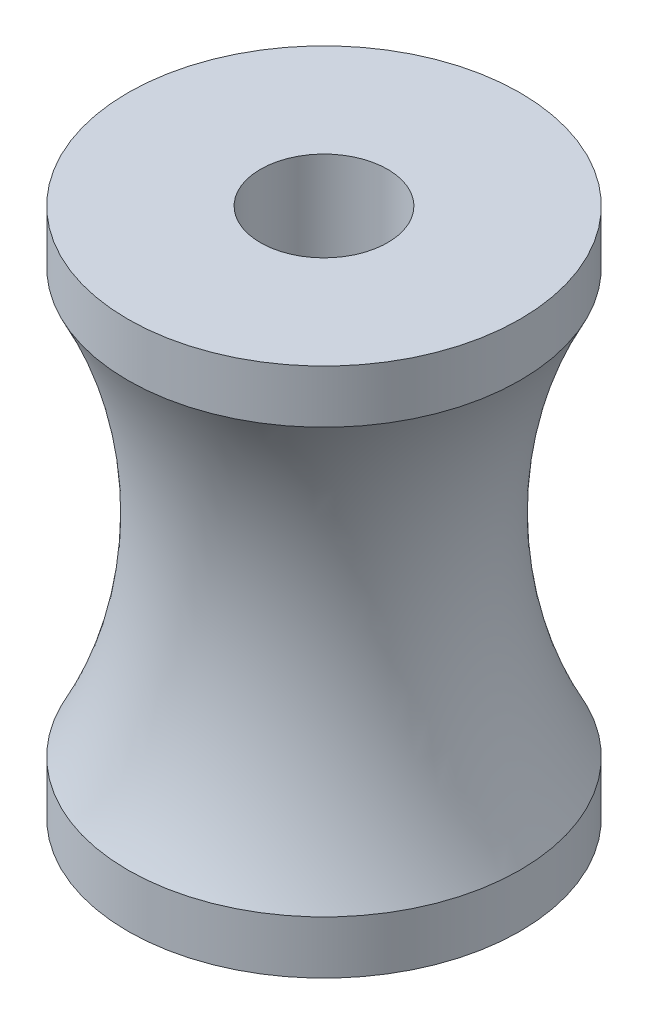
ISO-10303-21;
HEADER;
FILE_DESCRIPTION(('STEP AP214'),'2;1');
FILE_NAME('part.step','',(''),(''),'','','');
FILE_SCHEMA(('AUTOMOTIVE_DESIGN { 1 0 10303 214 1 1 1 1 }'));
ENDSEC;
DATA;
#1=APPLICATION_CONTEXT('core data for automotive mechanical design processes');
#2=APPLICATION_PROTOCOL_DEFINITION('international standard','automotive_design',2000,#1);
#3=PRODUCT_CONTEXT('',#1,'mechanical');
#4=PRODUCT('Part','Part','',(#3));
#5=PRODUCT_RELATED_PRODUCT_CATEGORY('part','',(#4));
#6=PRODUCT_DEFINITION_FORMATION('','',#4);
#7=PRODUCT_DEFINITION_CONTEXT('part definition',#1,'design');
#8=PRODUCT_DEFINITION('design','',#6,#7);
#9=PRODUCT_DEFINITION_SHAPE('','',#8);
#10=(LENGTH_UNIT() NAMED_UNIT(*) SI_UNIT(.MILLI.,.METRE.));
#11=(NAMED_UNIT(*) PLANE_ANGLE_UNIT() SI_UNIT($,.RADIAN.));
#12=(NAMED_UNIT(*) SI_UNIT($,.STERADIAN.) SOLID_ANGLE_UNIT());
#13=UNCERTAINTY_MEASURE_WITH_UNIT(LENGTH_MEASURE(1.E-05),#10,'distance_accuracy_value','');
#14=(GEOMETRIC_REPRESENTATION_CONTEXT(3) GLOBAL_UNCERTAINTY_ASSIGNED_CONTEXT((#13)) GLOBAL_UNIT_ASSIGNED_CONTEXT((#10,
#11,#12)) REPRESENTATION_CONTEXT('',''));
#15=CARTESIAN_POINT('',(0.,0.,0.));
#16=DIRECTION('',(0.,0.,1.));
#17=DIRECTION('',(1.,0.,0.));
#18=AXIS2_PLACEMENT_3D('',#15,#16,#17);
#19=CARTESIAN_POINT('',(-1.8302506003718E-13,500.,0.));
#20=DIRECTION('',(0.,1.,0.));
#21=DIRECTION('',(-1.,0.,0.));
#22=AXIS2_PLACEMENT_3D('',#19,#20,#21);
#23=CYLINDRICAL_SURFACE('',#22,120.);
#24=CARTESIAN_POINT('',(-1.8302506003718E-13,500.,0.));
#25=DIRECTION('',(0.,1.,0.));
#26=DIRECTION('',(-1.,0.,0.));
#27=AXIS2_PLACEMENT_3D('',#24,#25,#26);
#28=CIRCLE('',#27,120.);
#29=CARTESIAN_POINT('',(-120.,500.,0.));
#30=VERTEX_POINT('',#29);
#31=EDGE_CURVE('E70',#30,#30,#28,.T.);
#32=ORIENTED_EDGE('',*,*,#31,.T.);
#33=EDGE_LOOP('',(#32));
#34=FACE_BOUND('',#33,.T.);
#35=CARTESIAN_POINT('',(1.23136639749658E-13,-500.,0.));
#36=DIRECTION('',(0.,1.,0.));
#37=DIRECTION('',(-1.,0.,0.));
#38=AXIS2_PLACEMENT_3D('',#35,#36,#37);
#39=CIRCLE('',#38,120.);
#40=CARTESIAN_POINT('',(-120.,-500.,0.));
#41=VERTEX_POINT('',#40);
#42=EDGE_CURVE('E10',#41,#41,#39,.T.);
#43=ORIENTED_EDGE('',*,*,#42,.F.);
#44=EDGE_LOOP('',(#43));
#45=FACE_BOUND('',#44,.T.);
#46=ADVANCED_FACE('F43',(#34,#45),#23,.F.);
#47=CARTESIAN_POINT('',(-120.,-500.,0.));
#48=DIRECTION('',(0.,-1.,0.));
#49=DIRECTION('',(1.,0.,0.));
#50=AXIS2_PLACEMENT_3D('',#47,#48,#49);
#51=PLANE('',#50);
#52=ORIENTED_EDGE('',*,*,#42,.T.);
#53=EDGE_LOOP('',(#52));
#54=FACE_BOUND('',#53,.T.);
#55=CARTESIAN_POINT('',(1.23136639749658E-13,-500.,0.));
#56=DIRECTION('',(0.,1.,0.));
#57=DIRECTION('',(-1.,0.,0.));
#58=AXIS2_PLACEMENT_3D('',#55,#56,#57);
#59=CIRCLE('',#58,370.);
#60=CARTESIAN_POINT('',(-370.,-500.,0.));
#61=VERTEX_POINT('',#60);
#62=EDGE_CURVE('E50',#61,#61,#59,.T.);
#63=ORIENTED_EDGE('',*,*,#62,.F.);
#64=EDGE_LOOP('',(#63));
#65=FACE_BOUND('',#64,.T.);
#66=ADVANCED_FACE('F89',(#54,#65),#51,.T.);
#67=CARTESIAN_POINT('',(-1.8302506003718E-13,500.,0.));
#68=DIRECTION('',(0.,1.,0.));
#69=DIRECTION('',(-1.,0.,0.));
#70=AXIS2_PLACEMENT_3D('',#67,#68,#69);
#71=CYLINDRICAL_SURFACE('',#70,370.);
#72=ORIENTED_EDGE('',*,*,#62,.T.);
#73=EDGE_LOOP('',(#72));
#74=FACE_BOUND('',#73,.T.);
#75=CARTESIAN_POINT('',(0.,-400.,0.));
#76=DIRECTION('',(0.,1.,0.));
#77=DIRECTION('',(-1.,0.,0.));
#78=AXIS2_PLACEMENT_3D('',#75,#76,#77);
#79=CIRCLE('',#78,370.);
#80=CARTESIAN_POINT('',(-370.,-400.,0.));
#81=VERTEX_POINT('',#80);
#82=EDGE_CURVE('E55',#81,#81,#79,.T.);
#83=ORIENTED_EDGE('',*,*,#82,.F.);
#84=EDGE_LOOP('',(#83));
#85=FACE_BOUND('',#84,.T.);
#86=ADVANCED_FACE('F93',(#74,#85),#71,.T.);
#87=CARTESIAN_POINT('',(0.,2.22044604925031E-13,0.));
#88=DIRECTION('',(0.,1.,0.));
#89=DIRECTION('',(-1.,0.,0.));
#90=AXIS2_PLACEMENT_3D('',#87,#88,#89);
#91=TOROIDAL_SURFACE('',#90,1131.31465242697,860.);
#92=ORIENTED_EDGE('',*,*,#82,.T.);
#93=EDGE_LOOP('',(#92));
#94=FACE_BOUND('',#93,.T.);
#95=CARTESIAN_POINT('',(-1.52408890058496E-13,400.,0.));
#96=DIRECTION('',(0.,1.,0.));
#97=DIRECTION('',(-1.,0.,0.));
#98=AXIS2_PLACEMENT_3D('',#95,#96,#97);
#99=CIRCLE('',#98,370.);
#100=CARTESIAN_POINT('',(-370.,400.,0.));
#101=VERTEX_POINT('',#100);
#102=EDGE_CURVE('E60',#101,#101,#99,.T.);
#103=ORIENTED_EDGE('',*,*,#102,.F.);
#104=EDGE_LOOP('',(#103));
#105=FACE_BOUND('',#104,.T.);
#106=ADVANCED_FACE('F85',(#94,#105),#91,.F.);
#107=CARTESIAN_POINT('',(-1.8302506003718E-13,500.,0.));
#108=DIRECTION('',(0.,1.,0.));
#109=DIRECTION('',(-1.,0.,0.));
#110=AXIS2_PLACEMENT_3D('',#107,#108,#109);
#111=CYLINDRICAL_SURFACE('',#110,370.);
#112=ORIENTED_EDGE('',*,*,#102,.T.);
#113=EDGE_LOOP('',(#112));
#114=FACE_BOUND('',#113,.T.);
#115=CARTESIAN_POINT('',(-1.8302506003718E-13,500.,0.));
#116=DIRECTION('',(0.,1.,0.));
#117=DIRECTION('',(-1.,0.,0.));
#118=AXIS2_PLACEMENT_3D('',#115,#116,#117);
#119=CIRCLE('',#118,370.);
#120=CARTESIAN_POINT('',(-370.,500.,0.));
#121=VERTEX_POINT('',#120);
#122=EDGE_CURVE('E66',#121,#121,#119,.T.);
#123=ORIENTED_EDGE('',*,*,#122,.F.);
#124=EDGE_LOOP('',(#123));
#125=FACE_BOUND('',#124,.T.);
#126=ADVANCED_FACE('F79',(#114,#125),#111,.T.);
#127=CARTESIAN_POINT('',(-120.,500.,0.));
#128=DIRECTION('',(0.,1.,0.));
#129=DIRECTION('',(-1.,0.,0.));
#130=AXIS2_PLACEMENT_3D('',#127,#128,#129);
#131=PLANE('',#130);
#132=ORIENTED_EDGE('',*,*,#122,.T.);
#133=EDGE_LOOP('',(#132));
#134=FACE_BOUND('',#133,.T.);
#135=ORIENTED_EDGE('',*,*,#31,.F.);
#136=EDGE_LOOP('',(#135));
#137=FACE_BOUND('',#136,.T.);
#138=ADVANCED_FACE('F77',(#134,#137),#131,.T.);
#139=CLOSED_SHELL('',(#46,#66,#86,#106,#126,#138));
#140=MANIFOLD_SOLID_BREP('B2',#139);
#141=ADVANCED_BREP_SHAPE_REPRESENTATION('',(#18,#140),#14);
#142=SHAPE_DEFINITION_REPRESENTATION(#9,#141);
ENDSEC;
END-ISO-10303-21;
